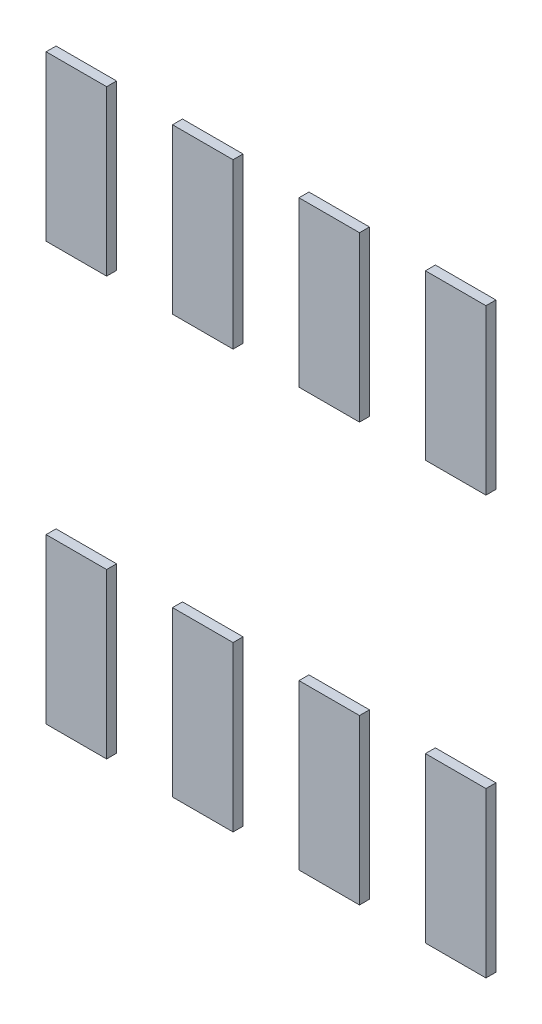
ISO-10303-21;
HEADER;
FILE_DESCRIPTION(('STEP AP214'),'2;1');
FILE_NAME('part.step','',(''),(''),'','','');
FILE_SCHEMA(('AUTOMOTIVE_DESIGN { 1 0 10303 214 1 1 1 1 }'));
ENDSEC;
DATA;
#1=APPLICATION_CONTEXT('core data for automotive mechanical design processes');
#2=APPLICATION_PROTOCOL_DEFINITION('international standard','automotive_design',2000,#1);
#3=PRODUCT_CONTEXT('',#1,'mechanical');
#4=PRODUCT('Part','Part','',(#3));
#5=PRODUCT_RELATED_PRODUCT_CATEGORY('part','',(#4));
#6=PRODUCT_DEFINITION_FORMATION('','',#4);
#7=PRODUCT_DEFINITION_CONTEXT('part definition',#1,'design');
#8=PRODUCT_DEFINITION('design','',#6,#7);
#9=PRODUCT_DEFINITION_SHAPE('','',#8);
#10=(LENGTH_UNIT() NAMED_UNIT(*) SI_UNIT(.MILLI.,.METRE.));
#11=(NAMED_UNIT(*) PLANE_ANGLE_UNIT() SI_UNIT($,.RADIAN.));
#12=(NAMED_UNIT(*) SI_UNIT($,.STERADIAN.) SOLID_ANGLE_UNIT());
#13=UNCERTAINTY_MEASURE_WITH_UNIT(LENGTH_MEASURE(1.E-05),#10,'distance_accuracy_value','');
#14=(GEOMETRIC_REPRESENTATION_CONTEXT(3) GLOBAL_UNCERTAINTY_ASSIGNED_CONTEXT((#13)) GLOBAL_UNIT_ASSIGNED_CONTEXT((#10,
#11,#12)) REPRESENTATION_CONTEXT('',''));
#15=CARTESIAN_POINT('',(0.,0.,0.));
#16=DIRECTION('',(0.,0.,1.));
#17=DIRECTION('',(1.,0.,0.));
#18=AXIS2_PLACEMENT_3D('',#15,#16,#17);
#19=CARTESIAN_POINT('',(-2.209,1.276,0.1));
#20=DIRECTION('',(0.,0.,1.));
#21=DIRECTION('',(1.,0.,0.));
#22=AXIS2_PLACEMENT_3D('',#19,#20,#21);
#23=PLANE('',#22);
#24=DIRECTION('',(0.,1.,0.));
#25=VECTOR('',#24,1.);
#26=CARTESIAN_POINT('',(-2.209,1.276,0.1));
#27=LINE('',#26,#25);
#28=CARTESIAN_POINT('',(-2.209,1.276,0.1));
#29=VERTEX_POINT('',#28);
#30=CARTESIAN_POINT('',(-2.209,2.924,0.1));
#31=VERTEX_POINT('',#30);
#32=EDGE_CURVE('P0_E89',#29,#31,#27,.T.);
#33=ORIENTED_EDGE('',*,*,#32,.F.);
#34=DIRECTION('',(1.,0.,0.));
#35=VECTOR('',#34,1.);
#36=CARTESIAN_POINT('',(-2.209,1.276,0.1));
#37=LINE('',#36,#35);
#38=CARTESIAN_POINT('',(-1.601,1.276,0.1));
#39=VERTEX_POINT('',#38);
#40=EDGE_CURVE('P0_E71',#29,#39,#37,.T.);
#41=ORIENTED_EDGE('',*,*,#40,.T.);
#42=DIRECTION('',(0.,1.,0.));
#43=VECTOR('',#42,1.);
#44=CARTESIAN_POINT('',(-1.601,1.276,0.1));
#45=LINE('',#44,#43);
#46=CARTESIAN_POINT('',(-1.601,2.924,0.1));
#47=VERTEX_POINT('',#46);
#48=EDGE_CURVE('P0_E83',#39,#47,#45,.T.);
#49=ORIENTED_EDGE('',*,*,#48,.T.);
#50=DIRECTION('',(1.,0.,0.));
#51=VECTOR('',#50,1.);
#52=CARTESIAN_POINT('',(-2.209,2.924,0.1));
#53=LINE('',#52,#51);
#54=EDGE_CURVE('P0_E11',#31,#47,#53,.T.);
#55=ORIENTED_EDGE('',*,*,#54,.F.);
#56=EDGE_LOOP('',(#33,#41,#49,#55));
#57=FACE_BOUND('',#56,.T.);
#58=ADVANCED_FACE('P0_F17',(#57),#23,.T.);
#59=CARTESIAN_POINT('',(-2.209,1.276,0.));
#60=DIRECTION('',(0.,0.,1.));
#61=DIRECTION('',(1.,0.,0.));
#62=AXIS2_PLACEMENT_3D('',#59,#60,#61);
#63=PLANE('',#62);
#64=DIRECTION('',(1.,0.,0.));
#65=VECTOR('',#64,1.);
#66=CARTESIAN_POINT('',(-2.209,2.924,0.));
#67=LINE('',#66,#65);
#68=CARTESIAN_POINT('',(-2.209,2.924,0.));
#69=VERTEX_POINT('',#68);
#70=CARTESIAN_POINT('',(-1.601,2.924,0.));
#71=VERTEX_POINT('',#70);
#72=EDGE_CURVE('P0_E26',#69,#71,#67,.T.);
#73=ORIENTED_EDGE('',*,*,#72,.T.);
#74=DIRECTION('',(0.,1.,0.));
#75=VECTOR('',#74,1.);
#76=CARTESIAN_POINT('',(-1.601,1.276,0.));
#77=LINE('',#76,#75);
#78=CARTESIAN_POINT('',(-1.601,1.276,0.));
#79=VERTEX_POINT('',#78);
#80=EDGE_CURVE('P0_E107',#79,#71,#77,.T.);
#81=ORIENTED_EDGE('',*,*,#80,.F.);
#82=DIRECTION('',(1.,0.,0.));
#83=VECTOR('',#82,1.);
#84=CARTESIAN_POINT('',(-2.209,1.276,0.));
#85=LINE('',#84,#83);
#86=CARTESIAN_POINT('',(-2.209,1.276,0.));
#87=VERTEX_POINT('',#86);
#88=EDGE_CURVE('P0_E82',#87,#79,#85,.T.);
#89=ORIENTED_EDGE('',*,*,#88,.F.);
#90=DIRECTION('',(0.,1.,0.));
#91=VECTOR('',#90,1.);
#92=CARTESIAN_POINT('',(-2.209,1.276,0.));
#93=LINE('',#92,#91);
#94=EDGE_CURVE('P0_E90',#87,#69,#93,.T.);
#95=ORIENTED_EDGE('',*,*,#94,.T.);
#96=EDGE_LOOP('',(#73,#81,#89,#95));
#97=FACE_BOUND('',#96,.T.);
#98=ADVANCED_FACE('P0_F19',(#97),#63,.F.);
#99=CARTESIAN_POINT('',(-2.209,2.924,0.));
#100=DIRECTION('',(0.,1.,0.));
#101=DIRECTION('',(1.,0.,0.));
#102=AXIS2_PLACEMENT_3D('',#99,#100,#101);
#103=PLANE('',#102);
#104=ORIENTED_EDGE('',*,*,#72,.F.);
#105=DIRECTION('',(0.,0.,1.));
#106=VECTOR('',#105,1.);
#107=CARTESIAN_POINT('',(-2.209,2.924,0.));
#108=LINE('',#107,#106);
#109=EDGE_CURVE('P0_E94',#69,#31,#108,.T.);
#110=ORIENTED_EDGE('',*,*,#109,.T.);
#111=ORIENTED_EDGE('',*,*,#54,.T.);
#112=DIRECTION('',(0.,0.,1.));
#113=VECTOR('',#112,1.);
#114=CARTESIAN_POINT('',(-1.601,2.924,0.));
#115=LINE('',#114,#113);
#116=EDGE_CURVE('P0_E112',#71,#47,#115,.T.);
#117=ORIENTED_EDGE('',*,*,#116,.F.);
#118=EDGE_LOOP('',(#104,#110,#111,#117));
#119=FACE_BOUND('',#118,.T.);
#120=ADVANCED_FACE('P0_F155',(#119),#103,.T.);
#121=CARTESIAN_POINT('',(-2.209,1.276,0.));
#122=DIRECTION('',(0.,1.,0.));
#123=DIRECTION('',(1.,0.,0.));
#124=AXIS2_PLACEMENT_3D('',#121,#122,#123);
#125=PLANE('',#124);
#126=DIRECTION('',(0.,0.,1.));
#127=VECTOR('',#126,1.);
#128=CARTESIAN_POINT('',(-1.601,1.276,0.));
#129=LINE('',#128,#127);
#130=EDGE_CURVE('P0_E77',#79,#39,#129,.T.);
#131=ORIENTED_EDGE('',*,*,#130,.T.);
#132=ORIENTED_EDGE('',*,*,#40,.F.);
#133=DIRECTION('',(0.,0.,1.));
#134=VECTOR('',#133,1.);
#135=CARTESIAN_POINT('',(-2.209,1.276,0.));
#136=LINE('',#135,#134);
#137=EDGE_CURVE('P0_E74',#87,#29,#136,.T.);
#138=ORIENTED_EDGE('',*,*,#137,.F.);
#139=ORIENTED_EDGE('',*,*,#88,.T.);
#140=EDGE_LOOP('',(#131,#132,#138,#139));
#141=FACE_BOUND('',#140,.T.);
#142=ADVANCED_FACE('P0_F73',(#141),#125,.F.);
#143=CARTESIAN_POINT('',(-1.601,1.276,0.));
#144=DIRECTION('',(1.,0.,0.));
#145=DIRECTION('',(0.,1.,0.));
#146=AXIS2_PLACEMENT_3D('',#143,#144,#145);
#147=PLANE('',#146);
#148=ORIENTED_EDGE('',*,*,#130,.F.);
#149=ORIENTED_EDGE('',*,*,#80,.T.);
#150=ORIENTED_EDGE('',*,*,#116,.T.);
#151=ORIENTED_EDGE('',*,*,#48,.F.);
#152=EDGE_LOOP('',(#148,#149,#150,#151));
#153=FACE_BOUND('',#152,.T.);
#154=ADVANCED_FACE('P0_F157',(#153),#147,.T.);
#155=CARTESIAN_POINT('',(-2.209,1.276,0.));
#156=DIRECTION('',(1.,0.,0.));
#157=DIRECTION('',(0.,1.,0.));
#158=AXIS2_PLACEMENT_3D('',#155,#156,#157);
#159=PLANE('',#158);
#160=ORIENTED_EDGE('',*,*,#32,.T.);
#161=ORIENTED_EDGE('',*,*,#109,.F.);
#162=ORIENTED_EDGE('',*,*,#94,.F.);
#163=ORIENTED_EDGE('',*,*,#137,.T.);
#164=EDGE_LOOP('',(#160,#161,#162,#163));
#165=FACE_BOUND('',#164,.T.);
#166=ADVANCED_FACE('P0_F87',(#165),#159,.F.);
#167=CLOSED_SHELL('',(#58,#98,#120,#142,#154,#166));
#168=MANIFOLD_SOLID_BREP('P0_B1',#167);
#169=CARTESIAN_POINT('',(-2.209,-2.924,0.1));
#170=DIRECTION('',(0.,0.,1.));
#171=DIRECTION('',(1.,0.,0.));
#172=AXIS2_PLACEMENT_3D('',#169,#170,#171);
#173=PLANE('',#172);
#174=DIRECTION('',(0.,1.,0.));
#175=VECTOR('',#174,1.);
#176=CARTESIAN_POINT('',(-2.209,-2.924,0.1));
#177=LINE('',#176,#175);
#178=CARTESIAN_POINT('',(-2.209,-2.924,0.1));
#179=VERTEX_POINT('',#178);
#180=CARTESIAN_POINT('',(-2.209,-1.276,0.1));
#181=VERTEX_POINT('',#180);
#182=EDGE_CURVE('P1_E88',#179,#181,#177,.T.);
#183=ORIENTED_EDGE('',*,*,#182,.F.);
#184=DIRECTION('',(1.,0.,0.));
#185=VECTOR('',#184,1.);
#186=CARTESIAN_POINT('',(-2.209,-2.924,0.1));
#187=LINE('',#186,#185);
#188=CARTESIAN_POINT('',(-1.601,-2.924,0.1));
#189=VERTEX_POINT('',#188);
#190=EDGE_CURVE('P1_E71',#179,#189,#187,.T.);
#191=ORIENTED_EDGE('',*,*,#190,.T.);
#192=DIRECTION('',(0.,1.,0.));
#193=VECTOR('',#192,1.);
#194=CARTESIAN_POINT('',(-1.601,-2.924,0.1));
#195=LINE('',#194,#193);
#196=CARTESIAN_POINT('',(-1.601,-1.276,0.1));
#197=VERTEX_POINT('',#196);
#198=EDGE_CURVE('P1_E83',#189,#197,#195,.T.);
#199=ORIENTED_EDGE('',*,*,#198,.T.);
#200=DIRECTION('',(1.,0.,0.));
#201=VECTOR('',#200,1.);
#202=CARTESIAN_POINT('',(-2.209,-1.276,0.1));
#203=LINE('',#202,#201);
#204=EDGE_CURVE('P1_E11',#181,#197,#203,.T.);
#205=ORIENTED_EDGE('',*,*,#204,.F.);
#206=EDGE_LOOP('',(#183,#191,#199,#205));
#207=FACE_BOUND('',#206,.T.);
#208=ADVANCED_FACE('P1_F17',(#207),#173,.T.);
#209=CARTESIAN_POINT('',(-2.209,-2.924,0.));
#210=DIRECTION('',(0.,0.,1.));
#211=DIRECTION('',(1.,0.,0.));
#212=AXIS2_PLACEMENT_3D('',#209,#210,#211);
#213=PLANE('',#212);
#214=DIRECTION('',(1.,0.,0.));
#215=VECTOR('',#214,1.);
#216=CARTESIAN_POINT('',(-2.209,-1.276,0.));
#217=LINE('',#216,#215);
#218=CARTESIAN_POINT('',(-2.209,-1.276,0.));
#219=VERTEX_POINT('',#218);
#220=CARTESIAN_POINT('',(-1.601,-1.276,0.));
#221=VERTEX_POINT('',#220);
#222=EDGE_CURVE('P1_E20',#219,#221,#217,.T.);
#223=ORIENTED_EDGE('',*,*,#222,.T.);
#224=DIRECTION('',(0.,1.,0.));
#225=VECTOR('',#224,1.);
#226=CARTESIAN_POINT('',(-1.601,-2.924,0.));
#227=LINE('',#226,#225);
#228=CARTESIAN_POINT('',(-1.601,-2.924,0.));
#229=VERTEX_POINT('',#228);
#230=EDGE_CURVE('P1_E101',#229,#221,#227,.T.);
#231=ORIENTED_EDGE('',*,*,#230,.F.);
#232=DIRECTION('',(1.,0.,0.));
#233=VECTOR('',#232,1.);
#234=CARTESIAN_POINT('',(-2.209,-2.924,0.));
#235=LINE('',#234,#233);
#236=CARTESIAN_POINT('',(-2.209,-2.924,0.));
#237=VERTEX_POINT('',#236);
#238=EDGE_CURVE('P1_E82',#237,#229,#235,.T.);
#239=ORIENTED_EDGE('',*,*,#238,.F.);
#240=DIRECTION('',(0.,1.,0.));
#241=VECTOR('',#240,1.);
#242=CARTESIAN_POINT('',(-2.209,-2.924,0.));
#243=LINE('',#242,#241);
#244=EDGE_CURVE('P1_E89',#237,#219,#243,.T.);
#245=ORIENTED_EDGE('',*,*,#244,.T.);
#246=EDGE_LOOP('',(#223,#231,#239,#245));
#247=FACE_BOUND('',#246,.T.);
#248=ADVANCED_FACE('P1_F121',(#247),#213,.F.);
#249=CARTESIAN_POINT('',(-2.209,-1.276,0.));
#250=DIRECTION('',(0.,1.,0.));
#251=DIRECTION('',(1.,0.,0.));
#252=AXIS2_PLACEMENT_3D('',#249,#250,#251);
#253=PLANE('',#252);
#254=ORIENTED_EDGE('',*,*,#222,.F.);
#255=DIRECTION('',(0.,0.,1.));
#256=VECTOR('',#255,1.);
#257=CARTESIAN_POINT('',(-2.209,-1.276,0.));
#258=LINE('',#257,#256);
#259=EDGE_CURVE('P1_E93',#219,#181,#258,.T.);
#260=ORIENTED_EDGE('',*,*,#259,.T.);
#261=ORIENTED_EDGE('',*,*,#204,.T.);
#262=DIRECTION('',(0.,0.,1.));
#263=VECTOR('',#262,1.);
#264=CARTESIAN_POINT('',(-1.601,-1.276,0.));
#265=LINE('',#264,#263);
#266=EDGE_CURVE('P1_E109',#221,#197,#265,.T.);
#267=ORIENTED_EDGE('',*,*,#266,.F.);
#268=EDGE_LOOP('',(#254,#260,#261,#267));
#269=FACE_BOUND('',#268,.T.);
#270=ADVANCED_FACE('P1_F119',(#269),#253,.T.);
#271=CARTESIAN_POINT('',(-2.209,-2.924,0.));
#272=DIRECTION('',(0.,1.,0.));
#273=DIRECTION('',(1.,0.,0.));
#274=AXIS2_PLACEMENT_3D('',#271,#272,#273);
#275=PLANE('',#274);
#276=DIRECTION('',(0.,0.,1.));
#277=VECTOR('',#276,1.);
#278=CARTESIAN_POINT('',(-1.601,-2.924,0.));
#279=LINE('',#278,#277);
#280=EDGE_CURVE('P1_E77',#229,#189,#279,.T.);
#281=ORIENTED_EDGE('',*,*,#280,.T.);
#282=ORIENTED_EDGE('',*,*,#190,.F.);
#283=DIRECTION('',(0.,0.,1.));
#284=VECTOR('',#283,1.);
#285=CARTESIAN_POINT('',(-2.209,-2.924,0.));
#286=LINE('',#285,#284);
#287=EDGE_CURVE('P1_E74',#237,#179,#286,.T.);
#288=ORIENTED_EDGE('',*,*,#287,.F.);
#289=ORIENTED_EDGE('',*,*,#238,.T.);
#290=EDGE_LOOP('',(#281,#282,#288,#289));
#291=FACE_BOUND('',#290,.T.);
#292=ADVANCED_FACE('P1_F73',(#291),#275,.F.);
#293=CARTESIAN_POINT('',(-1.601,-2.924,0.));
#294=DIRECTION('',(1.,0.,0.));
#295=DIRECTION('',(0.,1.,0.));
#296=AXIS2_PLACEMENT_3D('',#293,#294,#295);
#297=PLANE('',#296);
#298=ORIENTED_EDGE('',*,*,#280,.F.);
#299=ORIENTED_EDGE('',*,*,#230,.T.);
#300=ORIENTED_EDGE('',*,*,#266,.T.);
#301=ORIENTED_EDGE('',*,*,#198,.F.);
#302=EDGE_LOOP('',(#298,#299,#300,#301));
#303=FACE_BOUND('',#302,.T.);
#304=ADVANCED_FACE('P1_F118',(#303),#297,.T.);
#305=CARTESIAN_POINT('',(-2.209,-2.924,0.));
#306=DIRECTION('',(1.,0.,0.));
#307=DIRECTION('',(0.,1.,0.));
#308=AXIS2_PLACEMENT_3D('',#305,#306,#307);
#309=PLANE('',#308);
#310=ORIENTED_EDGE('',*,*,#182,.T.);
#311=ORIENTED_EDGE('',*,*,#259,.F.);
#312=ORIENTED_EDGE('',*,*,#244,.F.);
#313=ORIENTED_EDGE('',*,*,#287,.T.);
#314=EDGE_LOOP('',(#310,#311,#312,#313));
#315=FACE_BOUND('',#314,.T.);
#316=ADVANCED_FACE('P1_F86',(#315),#309,.F.);
#317=CLOSED_SHELL('',(#208,#248,#270,#292,#304,#316));
#318=MANIFOLD_SOLID_BREP('P1_B1',#317);
#319=CARTESIAN_POINT('',(-0.939,1.276,0.1));
#320=DIRECTION('',(0.,0.,1.));
#321=DIRECTION('',(1.,0.,0.));
#322=AXIS2_PLACEMENT_3D('',#319,#320,#321);
#323=PLANE('',#322);
#324=DIRECTION('',(0.,1.,0.));
#325=VECTOR('',#324,1.);
#326=CARTESIAN_POINT('',(-0.939,1.276,0.1));
#327=LINE('',#326,#325);
#328=CARTESIAN_POINT('',(-0.939,1.276,0.1));
#329=VERTEX_POINT('',#328);
#330=CARTESIAN_POINT('',(-0.939,2.924,0.1));
#331=VERTEX_POINT('',#330);
#332=EDGE_CURVE('P2_E88',#329,#331,#327,.T.);
#333=ORIENTED_EDGE('',*,*,#332,.F.);
#334=DIRECTION('',(1.,0.,0.));
#335=VECTOR('',#334,1.);
#336=CARTESIAN_POINT('',(-0.939,1.276,0.1));
#337=LINE('',#336,#335);
#338=CARTESIAN_POINT('',(-0.331,1.276,0.1));
#339=VERTEX_POINT('',#338);
#340=EDGE_CURVE('P2_E20',#329,#339,#337,.T.);
#341=ORIENTED_EDGE('',*,*,#340,.T.);
#342=DIRECTION('',(0.,1.,0.));
#343=VECTOR('',#342,1.);
#344=CARTESIAN_POINT('',(-0.331,1.276,0.1));
#345=LINE('',#344,#343);
#346=CARTESIAN_POINT('',(-0.331,2.924,0.1));
#347=VERTEX_POINT('',#346);
#348=EDGE_CURVE('P2_E83',#339,#347,#345,.T.);
#349=ORIENTED_EDGE('',*,*,#348,.T.);
#350=DIRECTION('',(1.,0.,0.));
#351=VECTOR('',#350,1.);
#352=CARTESIAN_POINT('',(-0.939,2.924,0.1));
#353=LINE('',#352,#351);
#354=EDGE_CURVE('P2_E11',#331,#347,#353,.T.);
#355=ORIENTED_EDGE('',*,*,#354,.F.);
#356=EDGE_LOOP('',(#333,#341,#349,#355));
#357=FACE_BOUND('',#356,.T.);
#358=ADVANCED_FACE('P2_F17',(#357),#323,.T.);
#359=CARTESIAN_POINT('',(-0.939,1.276,0.));
#360=DIRECTION('',(0.,0.,1.));
#361=DIRECTION('',(1.,0.,0.));
#362=AXIS2_PLACEMENT_3D('',#359,#360,#361);
#363=PLANE('',#362);
#364=DIRECTION('',(1.,0.,0.));
#365=VECTOR('',#364,1.);
#366=CARTESIAN_POINT('',(-0.939,2.924,0.));
#367=LINE('',#366,#365);
#368=CARTESIAN_POINT('',(-0.939,2.924,0.));
#369=VERTEX_POINT('',#368);
#370=CARTESIAN_POINT('',(-0.331,2.924,0.));
#371=VERTEX_POINT('',#370);
#372=EDGE_CURVE('P2_E26',#369,#371,#367,.T.);
#373=ORIENTED_EDGE('',*,*,#372,.T.);
#374=DIRECTION('',(0.,1.,0.));
#375=VECTOR('',#374,1.);
#376=CARTESIAN_POINT('',(-0.331,1.276,0.));
#377=LINE('',#376,#375);
#378=CARTESIAN_POINT('',(-0.331,1.276,0.));
#379=VERTEX_POINT('',#378);
#380=EDGE_CURVE('P2_E110',#379,#371,#377,.T.);
#381=ORIENTED_EDGE('',*,*,#380,.F.);
#382=DIRECTION('',(1.,0.,0.));
#383=VECTOR('',#382,1.);
#384=CARTESIAN_POINT('',(-0.939,1.276,0.));
#385=LINE('',#384,#383);
#386=CARTESIAN_POINT('',(-0.939,1.276,0.));
#387=VERTEX_POINT('',#386);
#388=EDGE_CURVE('P2_E82',#387,#379,#385,.T.);
#389=ORIENTED_EDGE('',*,*,#388,.F.);
#390=DIRECTION('',(0.,1.,0.));
#391=VECTOR('',#390,1.);
#392=CARTESIAN_POINT('',(-0.939,1.276,0.));
#393=LINE('',#392,#391);
#394=EDGE_CURVE('P2_E89',#387,#369,#393,.T.);
#395=ORIENTED_EDGE('',*,*,#394,.T.);
#396=EDGE_LOOP('',(#373,#381,#389,#395));
#397=FACE_BOUND('',#396,.T.);
#398=ADVANCED_FACE('P2_F119',(#397),#363,.F.);
#399=CARTESIAN_POINT('',(-0.939,2.924,0.));
#400=DIRECTION('',(0.,1.,0.));
#401=DIRECTION('',(1.,0.,0.));
#402=AXIS2_PLACEMENT_3D('',#399,#400,#401);
#403=PLANE('',#402);
#404=ORIENTED_EDGE('',*,*,#372,.F.);
#405=DIRECTION('',(0.,0.,1.));
#406=VECTOR('',#405,1.);
#407=CARTESIAN_POINT('',(-0.939,2.924,0.));
#408=LINE('',#407,#406);
#409=EDGE_CURVE('P2_E93',#369,#331,#408,.T.);
#410=ORIENTED_EDGE('',*,*,#409,.T.);
#411=ORIENTED_EDGE('',*,*,#354,.T.);
#412=DIRECTION('',(0.,0.,1.));
#413=VECTOR('',#412,1.);
#414=CARTESIAN_POINT('',(-0.331,2.924,0.));
#415=LINE('',#414,#413);
#416=EDGE_CURVE('P2_E107',#371,#347,#415,.T.);
#417=ORIENTED_EDGE('',*,*,#416,.F.);
#418=EDGE_LOOP('',(#404,#410,#411,#417));
#419=FACE_BOUND('',#418,.T.);
#420=ADVANCED_FACE('P2_F122',(#419),#403,.T.);
#421=CARTESIAN_POINT('',(-0.939,1.276,0.));
#422=DIRECTION('',(0.,1.,0.));
#423=DIRECTION('',(1.,0.,0.));
#424=AXIS2_PLACEMENT_3D('',#421,#422,#423);
#425=PLANE('',#424);
#426=DIRECTION('',(0.,0.,1.));
#427=VECTOR('',#426,1.);
#428=CARTESIAN_POINT('',(-0.331,1.276,0.));
#429=LINE('',#428,#427);
#430=EDGE_CURVE('P2_E77',#379,#339,#429,.T.);
#431=ORIENTED_EDGE('',*,*,#430,.T.);
#432=ORIENTED_EDGE('',*,*,#340,.F.);
#433=DIRECTION('',(0.,0.,1.));
#434=VECTOR('',#433,1.);
#435=CARTESIAN_POINT('',(-0.939,1.276,0.));
#436=LINE('',#435,#434);
#437=EDGE_CURVE('P2_E74',#387,#329,#436,.T.);
#438=ORIENTED_EDGE('',*,*,#437,.F.);
#439=ORIENTED_EDGE('',*,*,#388,.T.);
#440=EDGE_LOOP('',(#431,#432,#438,#439));
#441=FACE_BOUND('',#440,.T.);
#442=ADVANCED_FACE('P2_F73',(#441),#425,.F.);
#443=CARTESIAN_POINT('',(-0.331,1.276,0.));
#444=DIRECTION('',(1.,0.,0.));
#445=DIRECTION('',(0.,1.,0.));
#446=AXIS2_PLACEMENT_3D('',#443,#444,#445);
#447=PLANE('',#446);
#448=ORIENTED_EDGE('',*,*,#430,.F.);
#449=ORIENTED_EDGE('',*,*,#380,.T.);
#450=ORIENTED_EDGE('',*,*,#416,.T.);
#451=ORIENTED_EDGE('',*,*,#348,.F.);
#452=EDGE_LOOP('',(#448,#449,#450,#451));
#453=FACE_BOUND('',#452,.T.);
#454=ADVANCED_FACE('P2_F121',(#453),#447,.T.);
#455=CARTESIAN_POINT('',(-0.939,1.276,0.));
#456=DIRECTION('',(1.,0.,0.));
#457=DIRECTION('',(0.,1.,0.));
#458=AXIS2_PLACEMENT_3D('',#455,#456,#457);
#459=PLANE('',#458);
#460=ORIENTED_EDGE('',*,*,#332,.T.);
#461=ORIENTED_EDGE('',*,*,#409,.F.);
#462=ORIENTED_EDGE('',*,*,#394,.F.);
#463=ORIENTED_EDGE('',*,*,#437,.T.);
#464=EDGE_LOOP('',(#460,#461,#462,#463));
#465=FACE_BOUND('',#464,.T.);
#466=ADVANCED_FACE('P2_F86',(#465),#459,.F.);
#467=CLOSED_SHELL('',(#358,#398,#420,#442,#454,#466));
#468=MANIFOLD_SOLID_BREP('P2_B1',#467);
#469=CARTESIAN_POINT('',(-0.939,-2.924,0.1));
#470=DIRECTION('',(0.,0.,1.));
#471=DIRECTION('',(1.,0.,0.));
#472=AXIS2_PLACEMENT_3D('',#469,#470,#471);
#473=PLANE('',#472);
#474=DIRECTION('',(0.,1.,0.));
#475=VECTOR('',#474,1.);
#476=CARTESIAN_POINT('',(-0.939,-2.924,0.1));
#477=LINE('',#476,#475);
#478=CARTESIAN_POINT('',(-0.939,-2.924,0.1));
#479=VERTEX_POINT('',#478);
#480=CARTESIAN_POINT('',(-0.939,-1.276,0.1));
#481=VERTEX_POINT('',#480);
#482=EDGE_CURVE('P3_E144',#479,#481,#477,.T.);
#483=ORIENTED_EDGE('',*,*,#482,.F.);
#484=DIRECTION('',(1.,0.,0.));
#485=VECTOR('',#484,1.);
#486=CARTESIAN_POINT('',(-0.939,-2.924,0.1));
#487=LINE('',#486,#485);
#488=CARTESIAN_POINT('',(-0.331,-2.924,0.1));
#489=VERTEX_POINT('',#488);
#490=EDGE_CURVE('P3_E78',#479,#489,#487,.T.);
#491=ORIENTED_EDGE('',*,*,#490,.T.);
#492=DIRECTION('',(0.,1.,0.));
#493=VECTOR('',#492,1.);
#494=CARTESIAN_POINT('',(-0.331,-2.924,0.1));
#495=LINE('',#494,#493);
#496=CARTESIAN_POINT('',(-0.331,-1.276,0.1));
#497=VERTEX_POINT('',#496);
#498=EDGE_CURVE('P3_E90',#489,#497,#495,.T.);
#499=ORIENTED_EDGE('',*,*,#498,.T.);
#500=DIRECTION('',(1.,0.,0.));
#501=VECTOR('',#500,1.);
#502=CARTESIAN_POINT('',(-0.939,-1.276,0.1));
#503=LINE('',#502,#501);
#504=EDGE_CURVE('P3_E11',#481,#497,#503,.T.);
#505=ORIENTED_EDGE('',*,*,#504,.F.);
#506=EDGE_LOOP('',(#483,#491,#499,#505));
#507=FACE_BOUND('',#506,.T.);
#508=ADVANCED_FACE('P3_F17',(#507),#473,.T.);
#509=CARTESIAN_POINT('',(-0.939,-2.924,0.));
#510=DIRECTION('',(0.,0.,1.));
#511=DIRECTION('',(1.,0.,0.));
#512=AXIS2_PLACEMENT_3D('',#509,#510,#511);
#513=PLANE('',#512);
#514=DIRECTION('',(1.,0.,0.));
#515=VECTOR('',#514,1.);
#516=CARTESIAN_POINT('',(-0.939,-1.276,0.));
#517=LINE('',#516,#515);
#518=CARTESIAN_POINT('',(-0.939,-1.276,0.));
#519=VERTEX_POINT('',#518);
#520=CARTESIAN_POINT('',(-0.331,-1.276,0.));
#521=VERTEX_POINT('',#520);
#522=EDGE_CURVE('P3_E25',#519,#521,#517,.T.);
#523=ORIENTED_EDGE('',*,*,#522,.T.);
#524=DIRECTION('',(0.,1.,0.));
#525=VECTOR('',#524,1.);
#526=CARTESIAN_POINT('',(-0.331,-2.924,0.));
#527=LINE('',#526,#525);
#528=CARTESIAN_POINT('',(-0.331,-2.924,0.));
#529=VERTEX_POINT('',#528);
#530=EDGE_CURVE('P3_E81',#529,#521,#527,.T.);
#531=ORIENTED_EDGE('',*,*,#530,.F.);
#532=DIRECTION('',(1.,0.,0.));
#533=VECTOR('',#532,1.);
#534=CARTESIAN_POINT('',(-0.939,-2.924,0.));
#535=LINE('',#534,#533);
#536=CARTESIAN_POINT('',(-0.939,-2.924,0.));
#537=VERTEX_POINT('',#536);
#538=EDGE_CURVE('P3_E70',#537,#529,#535,.T.);
#539=ORIENTED_EDGE('',*,*,#538,.F.);
#540=DIRECTION('',(0.,1.,0.));
#541=VECTOR('',#540,1.);
#542=CARTESIAN_POINT('',(-0.939,-2.924,0.));
#543=LINE('',#542,#541);
#544=EDGE_CURVE('P3_E97',#537,#519,#543,.T.);
#545=ORIENTED_EDGE('',*,*,#544,.T.);
#546=EDGE_LOOP('',(#523,#531,#539,#545));
#547=FACE_BOUND('',#546,.T.);
#548=ADVANCED_FACE('P3_F82',(#547),#513,.F.);
#549=CARTESIAN_POINT('',(-0.939,-1.276,0.));
#550=DIRECTION('',(0.,1.,0.));
#551=DIRECTION('',(1.,0.,0.));
#552=AXIS2_PLACEMENT_3D('',#549,#550,#551);
#553=PLANE('',#552);
#554=ORIENTED_EDGE('',*,*,#522,.F.);
#555=DIRECTION('',(0.,0.,1.));
#556=VECTOR('',#555,1.);
#557=CARTESIAN_POINT('',(-0.939,-1.276,0.));
#558=LINE('',#557,#556);
#559=EDGE_CURVE('P3_E139',#519,#481,#558,.T.);
#560=ORIENTED_EDGE('',*,*,#559,.T.);
#561=ORIENTED_EDGE('',*,*,#504,.T.);
#562=DIRECTION('',(0.,0.,1.));
#563=VECTOR('',#562,1.);
#564=CARTESIAN_POINT('',(-0.331,-1.276,0.));
#565=LINE('',#564,#563);
#566=EDGE_CURVE('P3_E86',#521,#497,#565,.T.);
#567=ORIENTED_EDGE('',*,*,#566,.F.);
#568=EDGE_LOOP('',(#554,#560,#561,#567));
#569=FACE_BOUND('',#568,.T.);
#570=ADVANCED_FACE('P3_F157',(#569),#553,.T.);
#571=CARTESIAN_POINT('',(-0.939,-2.924,0.));
#572=DIRECTION('',(0.,1.,0.));
#573=DIRECTION('',(1.,0.,0.));
#574=AXIS2_PLACEMENT_3D('',#571,#572,#573);
#575=PLANE('',#574);
#576=DIRECTION('',(0.,0.,1.));
#577=VECTOR('',#576,1.);
#578=CARTESIAN_POINT('',(-0.331,-2.924,0.));
#579=LINE('',#578,#577);
#580=EDGE_CURVE('P3_E73',#529,#489,#579,.T.);
#581=ORIENTED_EDGE('',*,*,#580,.T.);
#582=ORIENTED_EDGE('',*,*,#490,.F.);
#583=DIRECTION('',(0.,0.,1.));
#584=VECTOR('',#583,1.);
#585=CARTESIAN_POINT('',(-0.939,-2.924,0.));
#586=LINE('',#585,#584);
#587=EDGE_CURVE('P3_E75',#537,#479,#586,.T.);
#588=ORIENTED_EDGE('',*,*,#587,.F.);
#589=ORIENTED_EDGE('',*,*,#538,.T.);
#590=EDGE_LOOP('',(#581,#582,#588,#589));
#591=FACE_BOUND('',#590,.T.);
#592=ADVANCED_FACE('P3_F71',(#591),#575,.F.);
#593=CARTESIAN_POINT('',(-0.331,-2.924,0.));
#594=DIRECTION('',(1.,0.,0.));
#595=DIRECTION('',(0.,1.,0.));
#596=AXIS2_PLACEMENT_3D('',#593,#594,#595);
#597=PLANE('',#596);
#598=ORIENTED_EDGE('',*,*,#580,.F.);
#599=ORIENTED_EDGE('',*,*,#530,.T.);
#600=ORIENTED_EDGE('',*,*,#566,.T.);
#601=ORIENTED_EDGE('',*,*,#498,.F.);
#602=EDGE_LOOP('',(#598,#599,#600,#601));
#603=FACE_BOUND('',#602,.T.);
#604=ADVANCED_FACE('P3_F89',(#603),#597,.T.);
#605=CARTESIAN_POINT('',(-0.939,-2.924,0.));
#606=DIRECTION('',(1.,0.,0.));
#607=DIRECTION('',(0.,1.,0.));
#608=AXIS2_PLACEMENT_3D('',#605,#606,#607);
#609=PLANE('',#608);
#610=ORIENTED_EDGE('',*,*,#482,.T.);
#611=ORIENTED_EDGE('',*,*,#559,.F.);
#612=ORIENTED_EDGE('',*,*,#544,.F.);
#613=ORIENTED_EDGE('',*,*,#587,.T.);
#614=EDGE_LOOP('',(#610,#611,#612,#613));
#615=FACE_BOUND('',#614,.T.);
#616=ADVANCED_FACE('P3_F155',(#615),#609,.F.);
#617=CLOSED_SHELL('',(#508,#548,#570,#592,#604,#616));
#618=MANIFOLD_SOLID_BREP('P3_B1',#617);
#619=CARTESIAN_POINT('',(0.331,1.276,0.1));
#620=DIRECTION('',(0.,0.,1.));
#621=DIRECTION('',(1.,0.,0.));
#622=AXIS2_PLACEMENT_3D('',#619,#620,#621);
#623=PLANE('',#622);
#624=DIRECTION('',(0.,1.,0.));
#625=VECTOR('',#624,1.);
#626=CARTESIAN_POINT('',(0.331,1.276,0.1));
#627=LINE('',#626,#625);
#628=CARTESIAN_POINT('',(0.331,1.276,0.1));
#629=VERTEX_POINT('',#628);
#630=CARTESIAN_POINT('',(0.331,2.924,0.1));
#631=VERTEX_POINT('',#630);
#632=EDGE_CURVE('P4_E89',#629,#631,#627,.T.);
#633=ORIENTED_EDGE('',*,*,#632,.F.);
#634=DIRECTION('',(1.,0.,0.));
#635=VECTOR('',#634,1.);
#636=CARTESIAN_POINT('',(0.331,1.276,0.1));
#637=LINE('',#636,#635);
#638=CARTESIAN_POINT('',(0.939,1.276,0.1));
#639=VERTEX_POINT('',#638);
#640=EDGE_CURVE('P4_E71',#629,#639,#637,.T.);
#641=ORIENTED_EDGE('',*,*,#640,.T.);
#642=DIRECTION('',(0.,1.,0.));
#643=VECTOR('',#642,1.);
#644=CARTESIAN_POINT('',(0.939,1.276,0.1));
#645=LINE('',#644,#643);
#646=CARTESIAN_POINT('',(0.939,2.924,0.1));
#647=VERTEX_POINT('',#646);
#648=EDGE_CURVE('P4_E83',#639,#647,#645,.T.);
#649=ORIENTED_EDGE('',*,*,#648,.T.);
#650=DIRECTION('',(1.,0.,0.));
#651=VECTOR('',#650,1.);
#652=CARTESIAN_POINT('',(0.331,2.924,0.1));
#653=LINE('',#652,#651);
#654=EDGE_CURVE('P4_E11',#631,#647,#653,.T.);
#655=ORIENTED_EDGE('',*,*,#654,.F.);
#656=EDGE_LOOP('',(#633,#641,#649,#655));
#657=FACE_BOUND('',#656,.T.);
#658=ADVANCED_FACE('P4_F17',(#657),#623,.T.);
#659=CARTESIAN_POINT('',(0.331,1.276,0.));
#660=DIRECTION('',(0.,0.,1.));
#661=DIRECTION('',(1.,0.,0.));
#662=AXIS2_PLACEMENT_3D('',#659,#660,#661);
#663=PLANE('',#662);
#664=DIRECTION('',(1.,0.,0.));
#665=VECTOR('',#664,1.);
#666=CARTESIAN_POINT('',(0.331,2.924,0.));
#667=LINE('',#666,#665);
#668=CARTESIAN_POINT('',(0.331,2.924,0.));
#669=VERTEX_POINT('',#668);
#670=CARTESIAN_POINT('',(0.939,2.924,0.));
#671=VERTEX_POINT('',#670);
#672=EDGE_CURVE('P4_E26',#669,#671,#667,.T.);
#673=ORIENTED_EDGE('',*,*,#672,.T.);
#674=DIRECTION('',(0.,1.,0.));
#675=VECTOR('',#674,1.);
#676=CARTESIAN_POINT('',(0.939,1.276,0.));
#677=LINE('',#676,#675);
#678=CARTESIAN_POINT('',(0.939,1.276,0.));
#679=VERTEX_POINT('',#678);
#680=EDGE_CURVE('P4_E106',#679,#671,#677,.T.);
#681=ORIENTED_EDGE('',*,*,#680,.F.);
#682=DIRECTION('',(1.,0.,0.));
#683=VECTOR('',#682,1.);
#684=CARTESIAN_POINT('',(0.331,1.276,0.));
#685=LINE('',#684,#683);
#686=CARTESIAN_POINT('',(0.331,1.276,0.));
#687=VERTEX_POINT('',#686);
#688=EDGE_CURVE('P4_E82',#687,#679,#685,.T.);
#689=ORIENTED_EDGE('',*,*,#688,.F.);
#690=DIRECTION('',(0.,1.,0.));
#691=VECTOR('',#690,1.);
#692=CARTESIAN_POINT('',(0.331,1.276,0.));
#693=LINE('',#692,#691);
#694=EDGE_CURVE('P4_E90',#687,#669,#693,.T.);
#695=ORIENTED_EDGE('',*,*,#694,.T.);
#696=EDGE_LOOP('',(#673,#681,#689,#695));
#697=FACE_BOUND('',#696,.T.);
#698=ADVANCED_FACE('P4_F19',(#697),#663,.F.);
#699=CARTESIAN_POINT('',(0.331,2.924,0.));
#700=DIRECTION('',(0.,1.,0.));
#701=DIRECTION('',(1.,0.,0.));
#702=AXIS2_PLACEMENT_3D('',#699,#700,#701);
#703=PLANE('',#702);
#704=ORIENTED_EDGE('',*,*,#672,.F.);
#705=DIRECTION('',(0.,0.,1.));
#706=VECTOR('',#705,1.);
#707=CARTESIAN_POINT('',(0.331,2.924,0.));
#708=LINE('',#707,#706);
#709=EDGE_CURVE('P4_E94',#669,#631,#708,.T.);
#710=ORIENTED_EDGE('',*,*,#709,.T.);
#711=ORIENTED_EDGE('',*,*,#654,.T.);
#712=DIRECTION('',(0.,0.,1.));
#713=VECTOR('',#712,1.);
#714=CARTESIAN_POINT('',(0.939,2.924,0.));
#715=LINE('',#714,#713);
#716=EDGE_CURVE('P4_E109',#671,#647,#715,.T.);
#717=ORIENTED_EDGE('',*,*,#716,.F.);
#718=EDGE_LOOP('',(#704,#710,#711,#717));
#719=FACE_BOUND('',#718,.T.);
#720=ADVANCED_FACE('P4_F182',(#719),#703,.T.);
#721=CARTESIAN_POINT('',(0.331,1.276,0.));
#722=DIRECTION('',(0.,1.,0.));
#723=DIRECTION('',(1.,0.,0.));
#724=AXIS2_PLACEMENT_3D('',#721,#722,#723);
#725=PLANE('',#724);
#726=DIRECTION('',(0.,0.,1.));
#727=VECTOR('',#726,1.);
#728=CARTESIAN_POINT('',(0.939,1.276,0.));
#729=LINE('',#728,#727);
#730=EDGE_CURVE('P4_E77',#679,#639,#729,.T.);
#731=ORIENTED_EDGE('',*,*,#730,.T.);
#732=ORIENTED_EDGE('',*,*,#640,.F.);
#733=DIRECTION('',(0.,0.,1.));
#734=VECTOR('',#733,1.);
#735=CARTESIAN_POINT('',(0.331,1.276,0.));
#736=LINE('',#735,#734);
#737=EDGE_CURVE('P4_E74',#687,#629,#736,.T.);
#738=ORIENTED_EDGE('',*,*,#737,.F.);
#739=ORIENTED_EDGE('',*,*,#688,.T.);
#740=EDGE_LOOP('',(#731,#732,#738,#739));
#741=FACE_BOUND('',#740,.T.);
#742=ADVANCED_FACE('P4_F73',(#741),#725,.F.);
#743=CARTESIAN_POINT('',(0.939,1.276,0.));
#744=DIRECTION('',(1.,0.,0.));
#745=DIRECTION('',(0.,1.,0.));
#746=AXIS2_PLACEMENT_3D('',#743,#744,#745);
#747=PLANE('',#746);
#748=ORIENTED_EDGE('',*,*,#730,.F.);
#749=ORIENTED_EDGE('',*,*,#680,.T.);
#750=ORIENTED_EDGE('',*,*,#716,.T.);
#751=ORIENTED_EDGE('',*,*,#648,.F.);
#752=EDGE_LOOP('',(#748,#749,#750,#751));
#753=FACE_BOUND('',#752,.T.);
#754=ADVANCED_FACE('P4_F161',(#753),#747,.T.);
#755=CARTESIAN_POINT('',(0.331,1.276,0.));
#756=DIRECTION('',(1.,0.,0.));
#757=DIRECTION('',(0.,1.,0.));
#758=AXIS2_PLACEMENT_3D('',#755,#756,#757);
#759=PLANE('',#758);
#760=ORIENTED_EDGE('',*,*,#632,.T.);
#761=ORIENTED_EDGE('',*,*,#709,.F.);
#762=ORIENTED_EDGE('',*,*,#694,.F.);
#763=ORIENTED_EDGE('',*,*,#737,.T.);
#764=EDGE_LOOP('',(#760,#761,#762,#763));
#765=FACE_BOUND('',#764,.T.);
#766=ADVANCED_FACE('P4_F87',(#765),#759,.F.);
#767=CLOSED_SHELL('',(#658,#698,#720,#742,#754,#766));
#768=MANIFOLD_SOLID_BREP('P4_B1',#767);
#769=CARTESIAN_POINT('',(0.331,-2.924,0.1));
#770=DIRECTION('',(0.,0.,1.));
#771=DIRECTION('',(1.,0.,0.));
#772=AXIS2_PLACEMENT_3D('',#769,#770,#771);
#773=PLANE('',#772);
#774=DIRECTION('',(0.,1.,0.));
#775=VECTOR('',#774,1.);
#776=CARTESIAN_POINT('',(0.331,-2.924,0.1));
#777=LINE('',#776,#775);
#778=CARTESIAN_POINT('',(0.331,-2.924,0.1));
#779=VERTEX_POINT('',#778);
#780=CARTESIAN_POINT('',(0.331,-1.276,0.1));
#781=VERTEX_POINT('',#780);
#782=EDGE_CURVE('P5_E89',#779,#781,#777,.T.);
#783=ORIENTED_EDGE('',*,*,#782,.F.);
#784=DIRECTION('',(1.,0.,0.));
#785=VECTOR('',#784,1.);
#786=CARTESIAN_POINT('',(0.331,-2.924,0.1));
#787=LINE('',#786,#785);
#788=CARTESIAN_POINT('',(0.939,-2.924,0.1));
#789=VERTEX_POINT('',#788);
#790=EDGE_CURVE('P5_E71',#779,#789,#787,.T.);
#791=ORIENTED_EDGE('',*,*,#790,.T.);
#792=DIRECTION('',(0.,1.,0.));
#793=VECTOR('',#792,1.);
#794=CARTESIAN_POINT('',(0.939,-2.924,0.1));
#795=LINE('',#794,#793);
#796=CARTESIAN_POINT('',(0.939,-1.276,0.1));
#797=VERTEX_POINT('',#796);
#798=EDGE_CURVE('P5_E83',#789,#797,#795,.T.);
#799=ORIENTED_EDGE('',*,*,#798,.T.);
#800=DIRECTION('',(1.,0.,0.));
#801=VECTOR('',#800,1.);
#802=CARTESIAN_POINT('',(0.331,-1.276,0.1));
#803=LINE('',#802,#801);
#804=EDGE_CURVE('P5_E11',#781,#797,#803,.T.);
#805=ORIENTED_EDGE('',*,*,#804,.F.);
#806=EDGE_LOOP('',(#783,#791,#799,#805));
#807=FACE_BOUND('',#806,.T.);
#808=ADVANCED_FACE('P5_F17',(#807),#773,.T.);
#809=CARTESIAN_POINT('',(0.331,-2.924,0.));
#810=DIRECTION('',(0.,0.,1.));
#811=DIRECTION('',(1.,0.,0.));
#812=AXIS2_PLACEMENT_3D('',#809,#810,#811);
#813=PLANE('',#812);
#814=DIRECTION('',(1.,0.,0.));
#815=VECTOR('',#814,1.);
#816=CARTESIAN_POINT('',(0.331,-1.276,0.));
#817=LINE('',#816,#815);
#818=CARTESIAN_POINT('',(0.331,-1.276,0.));
#819=VERTEX_POINT('',#818);
#820=CARTESIAN_POINT('',(0.939,-1.276,0.));
#821=VERTEX_POINT('',#820);
#822=EDGE_CURVE('P5_E26',#819,#821,#817,.T.);
#823=ORIENTED_EDGE('',*,*,#822,.T.);
#824=DIRECTION('',(0.,1.,0.));
#825=VECTOR('',#824,1.);
#826=CARTESIAN_POINT('',(0.939,-2.924,0.));
#827=LINE('',#826,#825);
#828=CARTESIAN_POINT('',(0.939,-2.924,0.));
#829=VERTEX_POINT('',#828);
#830=EDGE_CURVE('P5_E105',#829,#821,#827,.T.);
#831=ORIENTED_EDGE('',*,*,#830,.F.);
#832=DIRECTION('',(1.,0.,0.));
#833=VECTOR('',#832,1.);
#834=CARTESIAN_POINT('',(0.331,-2.924,0.));
#835=LINE('',#834,#833);
#836=CARTESIAN_POINT('',(0.331,-2.924,0.));
#837=VERTEX_POINT('',#836);
#838=EDGE_CURVE('P5_E82',#837,#829,#835,.T.);
#839=ORIENTED_EDGE('',*,*,#838,.F.);
#840=DIRECTION('',(0.,1.,0.));
#841=VECTOR('',#840,1.);
#842=CARTESIAN_POINT('',(0.331,-2.924,0.));
#843=LINE('',#842,#841);
#844=EDGE_CURVE('P5_E90',#837,#819,#843,.T.);
#845=ORIENTED_EDGE('',*,*,#844,.T.);
#846=EDGE_LOOP('',(#823,#831,#839,#845));
#847=FACE_BOUND('',#846,.T.);
#848=ADVANCED_FACE('P5_F120',(#847),#813,.F.);
#849=CARTESIAN_POINT('',(0.331,-1.276,0.));
#850=DIRECTION('',(0.,1.,0.));
#851=DIRECTION('',(1.,0.,0.));
#852=AXIS2_PLACEMENT_3D('',#849,#850,#851);
#853=PLANE('',#852);
#854=ORIENTED_EDGE('',*,*,#822,.F.);
#855=DIRECTION('',(0.,0.,1.));
#856=VECTOR('',#855,1.);
#857=CARTESIAN_POINT('',(0.331,-1.276,0.));
#858=LINE('',#857,#856);
#859=EDGE_CURVE('P5_E94',#819,#781,#858,.T.);
#860=ORIENTED_EDGE('',*,*,#859,.T.);
#861=ORIENTED_EDGE('',*,*,#804,.T.);
#862=DIRECTION('',(0.,0.,1.));
#863=VECTOR('',#862,1.);
#864=CARTESIAN_POINT('',(0.939,-1.276,0.));
#865=LINE('',#864,#863);
#866=EDGE_CURVE('P5_E102',#821,#797,#865,.T.);
#867=ORIENTED_EDGE('',*,*,#866,.F.);
#868=EDGE_LOOP('',(#854,#860,#861,#867));
#869=FACE_BOUND('',#868,.T.);
#870=ADVANCED_FACE('P5_F19',(#869),#853,.T.);
#871=CARTESIAN_POINT('',(0.331,-2.924,0.));
#872=DIRECTION('',(0.,1.,0.));
#873=DIRECTION('',(1.,0.,0.));
#874=AXIS2_PLACEMENT_3D('',#871,#872,#873);
#875=PLANE('',#874);
#876=DIRECTION('',(0.,0.,1.));
#877=VECTOR('',#876,1.);
#878=CARTESIAN_POINT('',(0.939,-2.924,0.));
#879=LINE('',#878,#877);
#880=EDGE_CURVE('P5_E77',#829,#789,#879,.T.);
#881=ORIENTED_EDGE('',*,*,#880,.T.);
#882=ORIENTED_EDGE('',*,*,#790,.F.);
#883=DIRECTION('',(0.,0.,1.));
#884=VECTOR('',#883,1.);
#885=CARTESIAN_POINT('',(0.331,-2.924,0.));
#886=LINE('',#885,#884);
#887=EDGE_CURVE('P5_E74',#837,#779,#886,.T.);
#888=ORIENTED_EDGE('',*,*,#887,.F.);
#889=ORIENTED_EDGE('',*,*,#838,.T.);
#890=EDGE_LOOP('',(#881,#882,#888,#889));
#891=FACE_BOUND('',#890,.T.);
#892=ADVANCED_FACE('P5_F73',(#891),#875,.F.);
#893=CARTESIAN_POINT('',(0.939,-2.924,0.));
#894=DIRECTION('',(1.,0.,0.));
#895=DIRECTION('',(0.,1.,0.));
#896=AXIS2_PLACEMENT_3D('',#893,#894,#895);
#897=PLANE('',#896);
#898=ORIENTED_EDGE('',*,*,#880,.F.);
#899=ORIENTED_EDGE('',*,*,#830,.T.);
#900=ORIENTED_EDGE('',*,*,#866,.T.);
#901=ORIENTED_EDGE('',*,*,#798,.F.);
#902=EDGE_LOOP('',(#898,#899,#900,#901));
#903=FACE_BOUND('',#902,.T.);
#904=ADVANCED_FACE('P5_F122',(#903),#897,.T.);
#905=CARTESIAN_POINT('',(0.331,-2.924,0.));
#906=DIRECTION('',(1.,0.,0.));
#907=DIRECTION('',(0.,1.,0.));
#908=AXIS2_PLACEMENT_3D('',#905,#906,#907);
#909=PLANE('',#908);
#910=ORIENTED_EDGE('',*,*,#782,.T.);
#911=ORIENTED_EDGE('',*,*,#859,.F.);
#912=ORIENTED_EDGE('',*,*,#844,.F.);
#913=ORIENTED_EDGE('',*,*,#887,.T.);
#914=EDGE_LOOP('',(#910,#911,#912,#913));
#915=FACE_BOUND('',#914,.T.);
#916=ADVANCED_FACE('P5_F87',(#915),#909,.F.);
#917=CLOSED_SHELL('',(#808,#848,#870,#892,#904,#916));
#918=MANIFOLD_SOLID_BREP('P5_B1',#917);
#919=CARTESIAN_POINT('',(1.601,1.276,0.1));
#920=DIRECTION('',(0.,0.,1.));
#921=DIRECTION('',(1.,0.,0.));
#922=AXIS2_PLACEMENT_3D('',#919,#920,#921);
#923=PLANE('',#922);
#924=DIRECTION('',(0.,1.,0.));
#925=VECTOR('',#924,1.);
#926=CARTESIAN_POINT('',(1.601,1.276,0.1));
#927=LINE('',#926,#925);
#928=CARTESIAN_POINT('',(1.601,1.276,0.1));
#929=VERTEX_POINT('',#928);
#930=CARTESIAN_POINT('',(1.601,2.924,0.1));
#931=VERTEX_POINT('',#930);
#932=EDGE_CURVE('P6_E88',#929,#931,#927,.T.);
#933=ORIENTED_EDGE('',*,*,#932,.F.);
#934=DIRECTION('',(1.,0.,0.));
#935=VECTOR('',#934,1.);
#936=CARTESIAN_POINT('',(1.601,1.276,0.1));
#937=LINE('',#936,#935);
#938=CARTESIAN_POINT('',(2.209,1.276,0.1));
#939=VERTEX_POINT('',#938);
#940=EDGE_CURVE('P6_E71',#929,#939,#937,.T.);
#941=ORIENTED_EDGE('',*,*,#940,.T.);
#942=DIRECTION('',(0.,1.,0.));
#943=VECTOR('',#942,1.);
#944=CARTESIAN_POINT('',(2.209,1.276,0.1));
#945=LINE('',#944,#943);
#946=CARTESIAN_POINT('',(2.209,2.924,0.1));
#947=VERTEX_POINT('',#946);
#948=EDGE_CURVE('P6_E83',#939,#947,#945,.T.);
#949=ORIENTED_EDGE('',*,*,#948,.T.);
#950=DIRECTION('',(1.,0.,0.));
#951=VECTOR('',#950,1.);
#952=CARTESIAN_POINT('',(1.601,2.924,0.1));
#953=LINE('',#952,#951);
#954=EDGE_CURVE('P6_E11',#931,#947,#953,.T.);
#955=ORIENTED_EDGE('',*,*,#954,.F.);
#956=EDGE_LOOP('',(#933,#941,#949,#955));
#957=FACE_BOUND('',#956,.T.);
#958=ADVANCED_FACE('P6_F17',(#957),#923,.T.);
#959=CARTESIAN_POINT('',(1.601,1.276,0.));
#960=DIRECTION('',(0.,0.,1.));
#961=DIRECTION('',(1.,0.,0.));
#962=AXIS2_PLACEMENT_3D('',#959,#960,#961);
#963=PLANE('',#962);
#964=DIRECTION('',(1.,0.,0.));
#965=VECTOR('',#964,1.);
#966=CARTESIAN_POINT('',(1.601,2.924,0.));
#967=LINE('',#966,#965);
#968=CARTESIAN_POINT('',(1.601,2.924,0.));
#969=VERTEX_POINT('',#968);
#970=CARTESIAN_POINT('',(2.209,2.924,0.));
#971=VERTEX_POINT('',#970);
#972=EDGE_CURVE('P6_E20',#969,#971,#967,.T.);
#973=ORIENTED_EDGE('',*,*,#972,.T.);
#974=DIRECTION('',(0.,1.,0.));
#975=VECTOR('',#974,1.);
#976=CARTESIAN_POINT('',(2.209,1.276,0.));
#977=LINE('',#976,#975);
#978=CARTESIAN_POINT('',(2.209,1.276,0.));
#979=VERTEX_POINT('',#978);
#980=EDGE_CURVE('P6_E106',#979,#971,#977,.T.);
#981=ORIENTED_EDGE('',*,*,#980,.F.);
#982=DIRECTION('',(1.,0.,0.));
#983=VECTOR('',#982,1.);
#984=CARTESIAN_POINT('',(1.601,1.276,0.));
#985=LINE('',#984,#983);
#986=CARTESIAN_POINT('',(1.601,1.276,0.));
#987=VERTEX_POINT('',#986);
#988=EDGE_CURVE('P6_E82',#987,#979,#985,.T.);
#989=ORIENTED_EDGE('',*,*,#988,.F.);
#990=DIRECTION('',(0.,1.,0.));
#991=VECTOR('',#990,1.);
#992=CARTESIAN_POINT('',(1.601,1.276,0.));
#993=LINE('',#992,#991);
#994=EDGE_CURVE('P6_E89',#987,#969,#993,.T.);
#995=ORIENTED_EDGE('',*,*,#994,.T.);
#996=EDGE_LOOP('',(#973,#981,#989,#995));
#997=FACE_BOUND('',#996,.T.);
#998=ADVANCED_FACE('P6_F121',(#997),#963,.F.);
#999=CARTESIAN_POINT('',(1.601,2.924,0.));
#1000=DIRECTION('',(0.,1.,0.));
#1001=DIRECTION('',(1.,0.,0.));
#1002=AXIS2_PLACEMENT_3D('',#999,#1000,#1001);
#1003=PLANE('',#1002);
#1004=ORIENTED_EDGE('',*,*,#972,.F.);
#1005=DIRECTION('',(0.,0.,1.));
#1006=VECTOR('',#1005,1.);
#1007=CARTESIAN_POINT('',(1.601,2.924,0.));
#1008=LINE('',#1007,#1006);
#1009=EDGE_CURVE('P6_E93',#969,#931,#1008,.T.);
#1010=ORIENTED_EDGE('',*,*,#1009,.T.);
#1011=ORIENTED_EDGE('',*,*,#954,.T.);
#1012=DIRECTION('',(0.,0.,1.));
#1013=VECTOR('',#1012,1.);
#1014=CARTESIAN_POINT('',(2.209,2.924,0.));
#1015=LINE('',#1014,#1013);
#1016=EDGE_CURVE('P6_E110',#971,#947,#1015,.T.);
#1017=ORIENTED_EDGE('',*,*,#1016,.F.);
#1018=EDGE_LOOP('',(#1004,#1010,#1011,#1017));
#1019=FACE_BOUND('',#1018,.T.);
#1020=ADVANCED_FACE('P6_F119',(#1019),#1003,.T.);
#1021=CARTESIAN_POINT('',(1.601,1.276,0.));
#1022=DIRECTION('',(0.,1.,0.));
#1023=DIRECTION('',(1.,0.,0.));
#1024=AXIS2_PLACEMENT_3D('',#1021,#1022,#1023);
#1025=PLANE('',#1024);
#1026=DIRECTION('',(0.,0.,1.));
#1027=VECTOR('',#1026,1.);
#1028=CARTESIAN_POINT('',(2.209,1.276,0.));
#1029=LINE('',#1028,#1027);
#1030=EDGE_CURVE('P6_E77',#979,#939,#1029,.T.);
#1031=ORIENTED_EDGE('',*,*,#1030,.T.);
#1032=ORIENTED_EDGE('',*,*,#940,.F.);
#1033=DIRECTION('',(0.,0.,1.));
#1034=VECTOR('',#1033,1.);
#1035=CARTESIAN_POINT('',(1.601,1.276,0.));
#1036=LINE('',#1035,#1034);
#1037=EDGE_CURVE('P6_E74',#987,#929,#1036,.T.);
#1038=ORIENTED_EDGE('',*,*,#1037,.F.);
#1039=ORIENTED_EDGE('',*,*,#988,.T.);
#1040=EDGE_LOOP('',(#1031,#1032,#1038,#1039));
#1041=FACE_BOUND('',#1040,.T.);
#1042=ADVANCED_FACE('P6_F73',(#1041),#1025,.F.);
#1043=CARTESIAN_POINT('',(2.209,1.276,0.));
#1044=DIRECTION('',(1.,0.,0.));
#1045=DIRECTION('',(0.,1.,0.));
#1046=AXIS2_PLACEMENT_3D('',#1043,#1044,#1045);
#1047=PLANE('',#1046);
#1048=ORIENTED_EDGE('',*,*,#1030,.F.);
#1049=ORIENTED_EDGE('',*,*,#980,.T.);
#1050=ORIENTED_EDGE('',*,*,#1016,.T.);
#1051=ORIENTED_EDGE('',*,*,#948,.F.);
#1052=EDGE_LOOP('',(#1048,#1049,#1050,#1051));
#1053=FACE_BOUND('',#1052,.T.);
#1054=ADVANCED_FACE('P6_F118',(#1053),#1047,.T.);
#1055=CARTESIAN_POINT('',(1.601,1.276,0.));
#1056=DIRECTION('',(1.,0.,0.));
#1057=DIRECTION('',(0.,1.,0.));
#1058=AXIS2_PLACEMENT_3D('',#1055,#1056,#1057);
#1059=PLANE('',#1058);
#1060=ORIENTED_EDGE('',*,*,#932,.T.);
#1061=ORIENTED_EDGE('',*,*,#1009,.F.);
#1062=ORIENTED_EDGE('',*,*,#994,.F.);
#1063=ORIENTED_EDGE('',*,*,#1037,.T.);
#1064=EDGE_LOOP('',(#1060,#1061,#1062,#1063));
#1065=FACE_BOUND('',#1064,.T.);
#1066=ADVANCED_FACE('P6_F86',(#1065),#1059,.F.);
#1067=CLOSED_SHELL('',(#958,#998,#1020,#1042,#1054,#1066));
#1068=MANIFOLD_SOLID_BREP('P6_B1',#1067);
#1069=CARTESIAN_POINT('',(1.601,-2.924,0.1));
#1070=DIRECTION('',(0.,0.,1.));
#1071=DIRECTION('',(1.,0.,0.));
#1072=AXIS2_PLACEMENT_3D('',#1069,#1070,#1071);
#1073=PLANE('',#1072);
#1074=DIRECTION('',(0.,1.,0.));
#1075=VECTOR('',#1074,1.);
#1076=CARTESIAN_POINT('',(1.601,-2.924,0.1));
#1077=LINE('',#1076,#1075);
#1078=CARTESIAN_POINT('',(1.601,-2.924,0.1));
#1079=VERTEX_POINT('',#1078);
#1080=CARTESIAN_POINT('',(1.601,-1.276,0.1));
#1081=VERTEX_POINT('',#1080);
#1082=EDGE_CURVE('P7_E88',#1079,#1081,#1077,.T.);
#1083=ORIENTED_EDGE('',*,*,#1082,.F.);
#1084=DIRECTION('',(1.,0.,0.));
#1085=VECTOR('',#1084,1.);
#1086=CARTESIAN_POINT('',(1.601,-2.924,0.1));
#1087=LINE('',#1086,#1085);
#1088=CARTESIAN_POINT('',(2.209,-2.924,0.1));
#1089=VERTEX_POINT('',#1088);
#1090=EDGE_CURVE('P7_E70',#1079,#1089,#1087,.T.);
#1091=ORIENTED_EDGE('',*,*,#1090,.T.);
#1092=DIRECTION('',(0.,1.,0.));
#1093=VECTOR('',#1092,1.);
#1094=CARTESIAN_POINT('',(2.209,-2.924,0.1));
#1095=LINE('',#1094,#1093);
#1096=CARTESIAN_POINT('',(2.209,-1.276,0.1));
#1097=VERTEX_POINT('',#1096);
#1098=EDGE_CURVE('P7_E82',#1089,#1097,#1095,.T.);
#1099=ORIENTED_EDGE('',*,*,#1098,.T.);
#1100=DIRECTION('',(1.,0.,0.));
#1101=VECTOR('',#1100,1.);
#1102=CARTESIAN_POINT('',(1.601,-1.276,0.1));
#1103=LINE('',#1102,#1101);
#1104=EDGE_CURVE('P7_E11',#1081,#1097,#1103,.T.);
#1105=ORIENTED_EDGE('',*,*,#1104,.F.);
#1106=EDGE_LOOP('',(#1083,#1091,#1099,#1105));
#1107=FACE_BOUND('',#1106,.T.);
#1108=ADVANCED_FACE('P7_F17',(#1107),#1073,.T.);
#1109=CARTESIAN_POINT('',(1.601,-2.924,0.));
#1110=DIRECTION('',(0.,0.,1.));
#1111=DIRECTION('',(1.,0.,0.));
#1112=AXIS2_PLACEMENT_3D('',#1109,#1110,#1111);
#1113=PLANE('',#1112);
#1114=DIRECTION('',(1.,0.,0.));
#1115=VECTOR('',#1114,1.);
#1116=CARTESIAN_POINT('',(1.601,-1.276,0.));
#1117=LINE('',#1116,#1115);
#1118=CARTESIAN_POINT('',(1.601,-1.276,0.));
#1119=VERTEX_POINT('',#1118);
#1120=CARTESIAN_POINT('',(2.209,-1.276,0.));
#1121=VERTEX_POINT('',#1120);
#1122=EDGE_CURVE('P7_E25',#1119,#1121,#1117,.T.);
#1123=ORIENTED_EDGE('',*,*,#1122,.T.);
#1124=DIRECTION('',(0.,1.,0.));
#1125=VECTOR('',#1124,1.);
#1126=CARTESIAN_POINT('',(2.209,-2.924,0.));
#1127=LINE('',#1126,#1125);
#1128=CARTESIAN_POINT('',(2.209,-2.924,0.));
#1129=VERTEX_POINT('',#1128);
#1130=EDGE_CURVE('P7_E105',#1129,#1121,#1127,.T.);
#1131=ORIENTED_EDGE('',*,*,#1130,.F.);
#1132=DIRECTION('',(1.,0.,0.));
#1133=VECTOR('',#1132,1.);
#1134=CARTESIAN_POINT('',(1.601,-2.924,0.));
#1135=LINE('',#1134,#1133);
#1136=CARTESIAN_POINT('',(1.601,-2.924,0.));
#1137=VERTEX_POINT('',#1136);
#1138=EDGE_CURVE('P7_E81',#1137,#1129,#1135,.T.);
#1139=ORIENTED_EDGE('',*,*,#1138,.F.);
#1140=DIRECTION('',(0.,1.,0.));
#1141=VECTOR('',#1140,1.);
#1142=CARTESIAN_POINT('',(1.601,-2.924,0.));
#1143=LINE('',#1142,#1141);
#1144=EDGE_CURVE('P7_E89',#1137,#1119,#1143,.T.);
#1145=ORIENTED_EDGE('',*,*,#1144,.T.);
#1146=EDGE_LOOP('',(#1123,#1131,#1139,#1145));
#1147=FACE_BOUND('',#1146,.T.);
#1148=ADVANCED_FACE('P7_F191',(#1147),#1113,.F.);
#1149=CARTESIAN_POINT('',(1.601,-1.276,0.));
#1150=DIRECTION('',(0.,1.,0.));
#1151=DIRECTION('',(1.,0.,0.));
#1152=AXIS2_PLACEMENT_3D('',#1149,#1150,#1151);
#1153=PLANE('',#1152);
#1154=ORIENTED_EDGE('',*,*,#1122,.F.);
#1155=DIRECTION('',(0.,0.,1.));
#1156=VECTOR('',#1155,1.);
#1157=CARTESIAN_POINT('',(1.601,-1.276,0.));
#1158=LINE('',#1157,#1156);
#1159=EDGE_CURVE('P7_E93',#1119,#1081,#1158,.T.);
#1160=ORIENTED_EDGE('',*,*,#1159,.T.);
#1161=ORIENTED_EDGE('',*,*,#1104,.T.);
#1162=DIRECTION('',(0.,0.,1.));
#1163=VECTOR('',#1162,1.);
#1164=CARTESIAN_POINT('',(2.209,-1.276,0.));
#1165=LINE('',#1164,#1163);
#1166=EDGE_CURVE('P7_E103',#1121,#1097,#1165,.T.);
#1167=ORIENTED_EDGE('',*,*,#1166,.F.);
#1168=EDGE_LOOP('',(#1154,#1160,#1161,#1167));
#1169=FACE_BOUND('',#1168,.T.);
#1170=ADVANCED_FACE('P7_F181',(#1169),#1153,.T.);
#1171=CARTESIAN_POINT('',(1.601,-2.924,0.));
#1172=DIRECTION('',(0.,1.,0.));
#1173=DIRECTION('',(1.,0.,0.));
#1174=AXIS2_PLACEMENT_3D('',#1171,#1172,#1173);
#1175=PLANE('',#1174);
#1176=DIRECTION('',(0.,0.,1.));
#1177=VECTOR('',#1176,1.);
#1178=CARTESIAN_POINT('',(2.209,-2.924,0.));
#1179=LINE('',#1178,#1177);
#1180=EDGE_CURVE('P7_E76',#1129,#1089,#1179,.T.);
#1181=ORIENTED_EDGE('',*,*,#1180,.T.);
#1182=ORIENTED_EDGE('',*,*,#1090,.F.);
#1183=DIRECTION('',(0.,0.,1.));
#1184=VECTOR('',#1183,1.);
#1185=CARTESIAN_POINT('',(1.601,-2.924,0.));
#1186=LINE('',#1185,#1184);
#1187=EDGE_CURVE('P7_E73',#1137,#1079,#1186,.T.);
#1188=ORIENTED_EDGE('',*,*,#1187,.F.);
#1189=ORIENTED_EDGE('',*,*,#1138,.T.);
#1190=EDGE_LOOP('',(#1181,#1182,#1188,#1189));
#1191=FACE_BOUND('',#1190,.T.);
#1192=ADVANCED_FACE('P7_F72',(#1191),#1175,.F.);
#1193=CARTESIAN_POINT('',(2.209,-2.924,0.));
#1194=DIRECTION('',(1.,0.,0.));
#1195=DIRECTION('',(0.,1.,0.));
#1196=AXIS2_PLACEMENT_3D('',#1193,#1194,#1195);
#1197=PLANE('',#1196);
#1198=ORIENTED_EDGE('',*,*,#1180,.F.);
#1199=ORIENTED_EDGE('',*,*,#1130,.T.);
#1200=ORIENTED_EDGE('',*,*,#1166,.T.);
#1201=ORIENTED_EDGE('',*,*,#1098,.F.);
#1202=EDGE_LOOP('',(#1198,#1199,#1200,#1201));
#1203=FACE_BOUND('',#1202,.T.);
#1204=ADVANCED_FACE('P7_F160',(#1203),#1197,.T.);
#1205=CARTESIAN_POINT('',(1.601,-2.924,0.));
#1206=DIRECTION('',(1.,0.,0.));
#1207=DIRECTION('',(0.,1.,0.));
#1208=AXIS2_PLACEMENT_3D('',#1205,#1206,#1207);
#1209=PLANE('',#1208);
#1210=ORIENTED_EDGE('',*,*,#1082,.T.);
#1211=ORIENTED_EDGE('',*,*,#1159,.F.);
#1212=ORIENTED_EDGE('',*,*,#1144,.F.);
#1213=ORIENTED_EDGE('',*,*,#1187,.T.);
#1214=EDGE_LOOP('',(#1210,#1211,#1212,#1213));
#1215=FACE_BOUND('',#1214,.T.);
#1216=ADVANCED_FACE('P7_F86',(#1215),#1209,.F.);
#1217=CLOSED_SHELL('',(#1108,#1148,#1170,#1192,#1204,#1216));
#1218=MANIFOLD_SOLID_BREP('P7_B1',#1217);
#1219=ADVANCED_BREP_SHAPE_REPRESENTATION('',(#18,#168,#318,#468,#618,#768,#918,#1068,#1218),#14);
#1220=SHAPE_DEFINITION_REPRESENTATION(#9,#1219);
ENDSEC;
END-ISO-10303-21;
